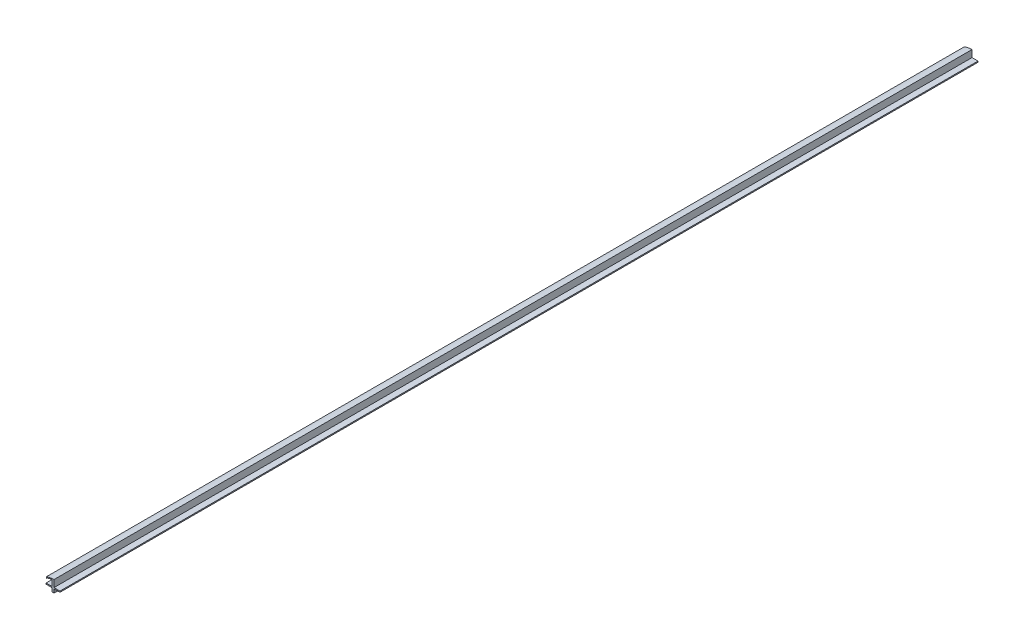
ISO-10303-21;
HEADER;
FILE_DESCRIPTION(('STEP AP214'),'2;1');
FILE_NAME('part.step','',(''),(''),'','','');
FILE_SCHEMA(('AUTOMOTIVE_DESIGN { 1 0 10303 214 1 1 1 1 }'));
ENDSEC;
DATA;
#1=APPLICATION_CONTEXT('core data for automotive mechanical design processes');
#2=APPLICATION_PROTOCOL_DEFINITION('international standard','automotive_design',2000,#1);
#3=PRODUCT_CONTEXT('',#1,'mechanical');
#4=PRODUCT('Part','Part','',(#3));
#5=PRODUCT_RELATED_PRODUCT_CATEGORY('part','',(#4));
#6=PRODUCT_DEFINITION_FORMATION('','',#4);
#7=PRODUCT_DEFINITION_CONTEXT('part definition',#1,'design');
#8=PRODUCT_DEFINITION('design','',#6,#7);
#9=PRODUCT_DEFINITION_SHAPE('','',#8);
#10=(LENGTH_UNIT() NAMED_UNIT(*) SI_UNIT(.MILLI.,.METRE.));
#11=(NAMED_UNIT(*) PLANE_ANGLE_UNIT() SI_UNIT($,.RADIAN.));
#12=(NAMED_UNIT(*) SI_UNIT($,.STERADIAN.) SOLID_ANGLE_UNIT());
#13=UNCERTAINTY_MEASURE_WITH_UNIT(LENGTH_MEASURE(1.E-05),#10,'distance_accuracy_value','');
#14=(GEOMETRIC_REPRESENTATION_CONTEXT(3) GLOBAL_UNCERTAINTY_ASSIGNED_CONTEXT((#13)) GLOBAL_UNIT_ASSIGNED_CONTEXT((#10,
#11,#12)) REPRESENTATION_CONTEXT('',''));
#15=CARTESIAN_POINT('',(0.,0.,0.));
#16=DIRECTION('',(0.,0.,1.));
#17=DIRECTION('',(1.,0.,0.));
#18=AXIS2_PLACEMENT_3D('',#15,#16,#17);
#19=CARTESIAN_POINT('',(1169.5811,22.86,533.4));
#20=DIRECTION('',(0.,1.,0.));
#21=DIRECTION('',(0.,0.,1.));
#22=AXIS2_PLACEMENT_3D('',#19,#20,#21);
#23=PLANE('',#22);
#24=DIRECTION('',(1.,0.,0.));
#25=VECTOR('',#24,1.);
#26=CARTESIAN_POINT('',(1169.5811,22.86,-533.4));
#27=LINE('',#26,#25);
#28=CARTESIAN_POINT('',(1169.5811,22.86,-533.4));
#29=VERTEX_POINT('',#28);
#30=CARTESIAN_POINT('',(1176.528,22.86,-533.4));
#31=VERTEX_POINT('',#30);
#32=EDGE_CURVE('E163',#29,#31,#27,.T.);
#33=ORIENTED_EDGE('',*,*,#32,.T.);
#34=DIRECTION('',(0.,0.,-1.));
#35=VECTOR('',#34,1.);
#36=CARTESIAN_POINT('',(1176.528,22.86,533.4));
#37=LINE('',#36,#35);
#38=CARTESIAN_POINT('',(1176.528,22.86,533.4));
#39=VERTEX_POINT('',#38);
#40=EDGE_CURVE('E11',#39,#31,#37,.T.);
#41=ORIENTED_EDGE('',*,*,#40,.F.);
#42=DIRECTION('',(1.,0.,0.));
#43=VECTOR('',#42,1.);
#44=CARTESIAN_POINT('',(1169.5811,22.86,533.4));
#45=LINE('',#44,#43);
#46=CARTESIAN_POINT('',(1169.5811,22.86,533.4));
#47=VERTEX_POINT('',#46);
#48=EDGE_CURVE('E189',#47,#39,#45,.T.);
#49=ORIENTED_EDGE('',*,*,#48,.F.);
#50=DIRECTION('',(0.,0.,-1.));
#51=VECTOR('',#50,1.);
#52=CARTESIAN_POINT('',(1169.5811,22.86,533.4));
#53=LINE('',#52,#51);
#54=EDGE_CURVE('E159',#47,#29,#53,.T.);
#55=ORIENTED_EDGE('',*,*,#54,.T.);
#56=EDGE_LOOP('',(#33,#41,#49,#55));
#57=FACE_BOUND('',#56,.T.);
#58=ADVANCED_FACE('F31',(#57),#23,.F.);
#59=CARTESIAN_POINT('',(1176.528,24.13,533.4));
#60=DIRECTION('',(-1.,0.,0.));
#61=DIRECTION('',(0.,0.,1.));
#62=AXIS2_PLACEMENT_3D('',#59,#60,#61);
#63=PLANE('',#62);
#64=DIRECTION('',(0.,1.,0.));
#65=VECTOR('',#64,1.);
#66=CARTESIAN_POINT('',(1176.528,24.13,-533.4));
#67=LINE('',#66,#65);
#68=CARTESIAN_POINT('',(1176.528,24.13,-533.4));
#69=VERTEX_POINT('',#68);
#70=EDGE_CURVE('E166',#31,#69,#67,.T.);
#71=ORIENTED_EDGE('',*,*,#70,.T.);
#72=DIRECTION('',(0.,0.,-1.));
#73=VECTOR('',#72,1.);
#74=CARTESIAN_POINT('',(1176.528,24.13,533.4));
#75=LINE('',#74,#73);
#76=CARTESIAN_POINT('',(1176.528,24.13,533.4));
#77=VERTEX_POINT('',#76);
#78=EDGE_CURVE('E39',#77,#69,#75,.T.);
#79=ORIENTED_EDGE('',*,*,#78,.F.);
#80=DIRECTION('',(0.,1.,0.));
#81=VECTOR('',#80,1.);
#82=CARTESIAN_POINT('',(1176.528,24.13,533.4));
#83=LINE('',#82,#81);
#84=EDGE_CURVE('E108',#39,#77,#83,.T.);
#85=ORIENTED_EDGE('',*,*,#84,.F.);
#86=ORIENTED_EDGE('',*,*,#40,.T.);
#87=EDGE_LOOP('',(#71,#79,#85,#86));
#88=FACE_BOUND('',#87,.T.);
#89=ADVANCED_FACE('F277',(#88),#63,.F.);
#90=CARTESIAN_POINT('',(1176.528,24.13,533.4));
#91=DIRECTION('',(0.,-1.,0.));
#92=DIRECTION('',(0.,0.,-1.));
#93=AXIS2_PLACEMENT_3D('',#90,#91,#92);
#94=PLANE('',#93);
#95=DIRECTION('',(-1.,0.,0.));
#96=VECTOR('',#95,1.);
#97=CARTESIAN_POINT('',(1176.528,24.13,-533.4));
#98=LINE('',#97,#96);
#99=CARTESIAN_POINT('',(1169.5811,24.13,-533.4));
#100=VERTEX_POINT('',#99);
#101=EDGE_CURVE('E168',#69,#100,#98,.T.);
#102=ORIENTED_EDGE('',*,*,#101,.T.);
#103=DIRECTION('',(0.,0.,-1.));
#104=VECTOR('',#103,1.);
#105=CARTESIAN_POINT('',(1169.5811,24.13,533.4));
#106=LINE('',#105,#104);
#107=CARTESIAN_POINT('',(1169.5811,24.13,533.4));
#108=VERTEX_POINT('',#107);
#109=EDGE_CURVE('E214',#108,#100,#106,.T.);
#110=ORIENTED_EDGE('',*,*,#109,.F.);
#111=DIRECTION('',(-1.,0.,0.));
#112=VECTOR('',#111,1.);
#113=CARTESIAN_POINT('',(1176.528,24.13,533.4));
#114=LINE('',#113,#112);
#115=EDGE_CURVE('E222',#77,#108,#114,.T.);
#116=ORIENTED_EDGE('',*,*,#115,.F.);
#117=ORIENTED_EDGE('',*,*,#78,.T.);
#118=EDGE_LOOP('',(#102,#110,#116,#117));
#119=FACE_BOUND('',#118,.T.);
#120=ADVANCED_FACE('F220',(#119),#94,.F.);
#121=CARTESIAN_POINT('',(1169.5811,32.258,533.4));
#122=DIRECTION('',(-1.,0.,0.));
#123=DIRECTION('',(0.,0.,1.));
#124=AXIS2_PLACEMENT_3D('',#121,#122,#123);
#125=PLANE('',#124);
#126=DIRECTION('',(0.,1.,0.));
#127=VECTOR('',#126,1.);
#128=CARTESIAN_POINT('',(1169.5811,32.258,-533.4));
#129=LINE('',#128,#127);
#130=CARTESIAN_POINT('',(1169.5811,32.258,-533.4));
#131=VERTEX_POINT('',#130);
#132=EDGE_CURVE('E170',#100,#131,#129,.T.);
#133=ORIENTED_EDGE('',*,*,#132,.T.);
#134=DIRECTION('',(0.,0.,-1.));
#135=VECTOR('',#134,1.);
#136=CARTESIAN_POINT('',(1169.5811,32.258,533.4));
#137=LINE('',#136,#135);
#138=CARTESIAN_POINT('',(1169.5811,32.258,533.4));
#139=VERTEX_POINT('',#138);
#140=EDGE_CURVE('E211',#139,#131,#137,.T.);
#141=ORIENTED_EDGE('',*,*,#140,.F.);
#142=DIRECTION('',(0.,1.,0.));
#143=VECTOR('',#142,1.);
#144=CARTESIAN_POINT('',(1169.5811,32.258,533.4));
#145=LINE('',#144,#143);
#146=EDGE_CURVE('E240',#108,#139,#145,.T.);
#147=ORIENTED_EDGE('',*,*,#146,.F.);
#148=ORIENTED_EDGE('',*,*,#109,.T.);
#149=EDGE_LOOP('',(#133,#141,#147,#148));
#150=FACE_BOUND('',#149,.T.);
#151=ADVANCED_FACE('F231',(#150),#125,.F.);
#152=CARTESIAN_POINT('',(1169.5811,9.17896278727341,533.4));
#153=DIRECTION('',(0.,0.,-1.));
#154=DIRECTION('',(-1.,0.,0.));
#155=AXIS2_PLACEMENT_3D('',#152,#153,#154);
#156=CYLINDRICAL_SURFACE('',#155,23.0790372127266);
#157=CARTESIAN_POINT('',(1169.5811,9.17896278727341,-533.4));
#158=DIRECTION('',(0.,0.,1.));
#159=DIRECTION('',(1.,0.,0.));
#160=AXIS2_PLACEMENT_3D('',#157,#158,#159);
#161=CIRCLE('',#160,23.0790372127266);
#162=CARTESIAN_POINT('',(1160.48380108106,30.3893637982359,-533.4));
#163=VERTEX_POINT('',#162);
#164=EDGE_CURVE('E172',#131,#163,#161,.T.);
#165=ORIENTED_EDGE('',*,*,#164,.T.);
#166=DIRECTION('',(0.,0.,-1.));
#167=VECTOR('',#166,1.);
#168=CARTESIAN_POINT('',(1160.48380108106,30.3893637982359,533.4));
#169=LINE('',#168,#167);
#170=CARTESIAN_POINT('',(1160.48380108106,30.3893637982359,533.4));
#171=VERTEX_POINT('',#170);
#172=EDGE_CURVE('E208',#171,#163,#169,.T.);
#173=ORIENTED_EDGE('',*,*,#172,.F.);
#174=CARTESIAN_POINT('',(1169.5811,9.17896278727341,533.4));
#175=DIRECTION('',(0.,0.,1.));
#176=DIRECTION('',(1.,0.,0.));
#177=AXIS2_PLACEMENT_3D('',#174,#175,#176);
#178=CIRCLE('',#177,23.0790372127266);
#179=EDGE_CURVE('E237',#139,#171,#178,.T.);
#180=ORIENTED_EDGE('',*,*,#179,.F.);
#181=ORIENTED_EDGE('',*,*,#140,.T.);
#182=EDGE_LOOP('',(#165,#173,#180,#181));
#183=FACE_BOUND('',#182,.T.);
#184=ADVANCED_FACE('F235',(#183),#156,.T.);
#185=CARTESIAN_POINT('',(1160.48380108106,30.3893637982359,533.4));
#186=DIRECTION('',(0.942734176006598,0.333545009540183,0.));
#187=DIRECTION('',(-0.333545009540183,0.942734176006598,0.));
#188=AXIS2_PLACEMENT_3D('',#185,#186,#187);
#189=PLANE('',#188);
#190=DIRECTION('',(0.333545009540183,-0.942734176006598,0.));
#191=VECTOR('',#190,1.);
#192=CARTESIAN_POINT('',(1160.48380108106,30.3893637982359,-533.4));
#193=LINE('',#192,#191);
#194=CARTESIAN_POINT('',(1160.90740324317,29.1920913947075,-533.4));
#195=VERTEX_POINT('',#194);
#196=EDGE_CURVE('E174',#163,#195,#193,.T.);
#197=ORIENTED_EDGE('',*,*,#196,.T.);
#198=DIRECTION('',(0.,0.,-1.));
#199=VECTOR('',#198,1.);
#200=CARTESIAN_POINT('',(1160.90740324317,29.1920913947075,533.4));
#201=LINE('',#200,#199);
#202=CARTESIAN_POINT('',(1160.90740324317,29.1920913947075,533.4));
#203=VERTEX_POINT('',#202);
#204=EDGE_CURVE('E205',#203,#195,#201,.T.);
#205=ORIENTED_EDGE('',*,*,#204,.F.);
#206=DIRECTION('',(0.333545009540183,-0.942734176006598,0.));
#207=VECTOR('',#206,1.);
#208=CARTESIAN_POINT('',(1160.48380108106,30.3893637982359,533.4));
#209=LINE('',#208,#207);
#210=EDGE_CURVE('E239',#171,#203,#209,.T.);
#211=ORIENTED_EDGE('',*,*,#210,.F.);
#212=ORIENTED_EDGE('',*,*,#172,.T.);
#213=EDGE_LOOP('',(#197,#205,#211,#212));
#214=FACE_BOUND('',#213,.T.);
#215=ADVANCED_FACE('F290',(#214),#189,.F.);
#216=CARTESIAN_POINT('',(1167.2189,18.9995616955442,533.4));
#217=DIRECTION('',(0.,0.,-1.));
#218=DIRECTION('',(-1.,0.,0.));
#219=AXIS2_PLACEMENT_3D('',#216,#217,#218);
#220=CYLINDRICAL_SURFACE('',#219,11.9884383044559);
#221=CARTESIAN_POINT('',(1167.2189,18.9995616955442,-533.4));
#222=DIRECTION('',(0.,0.,-1.));
#223=DIRECTION('',(1.,0.,0.));
#224=AXIS2_PLACEMENT_3D('',#221,#222,#223);
#225=CIRCLE('',#224,11.9884383044559);
#226=CARTESIAN_POINT('',(1167.2189,30.988,-533.4));
#227=VERTEX_POINT('',#226);
#228=EDGE_CURVE('E176',#195,#227,#225,.T.);
#229=ORIENTED_EDGE('',*,*,#228,.T.);
#230=DIRECTION('',(0.,0.,-1.));
#231=VECTOR('',#230,1.);
#232=CARTESIAN_POINT('',(1167.2189,30.988,533.4));
#233=LINE('',#232,#231);
#234=CARTESIAN_POINT('',(1167.2189,30.988,533.4));
#235=VERTEX_POINT('',#234);
#236=EDGE_CURVE('E202',#235,#227,#233,.T.);
#237=ORIENTED_EDGE('',*,*,#236,.F.);
#238=CARTESIAN_POINT('',(1167.2189,18.9995616955442,533.4));
#239=DIRECTION('',(0.,0.,-1.));
#240=DIRECTION('',(1.,0.,0.));
#241=AXIS2_PLACEMENT_3D('',#238,#239,#240);
#242=CIRCLE('',#241,11.9884383044559);
#243=EDGE_CURVE('E242',#203,#235,#242,.T.);
#244=ORIENTED_EDGE('',*,*,#243,.F.);
#245=ORIENTED_EDGE('',*,*,#204,.T.);
#246=EDGE_LOOP('',(#229,#237,#244,#245));
#247=FACE_BOUND('',#246,.T.);
#248=ADVANCED_FACE('F293',(#247),#220,.F.);
#249=CARTESIAN_POINT('',(1167.2189,30.988,533.4));
#250=DIRECTION('',(1.,0.,0.));
#251=DIRECTION('',(0.,0.,-1.));
#252=AXIS2_PLACEMENT_3D('',#249,#250,#251);
#253=PLANE('',#252);
#254=DIRECTION('',(0.,-1.,0.));
#255=VECTOR('',#254,1.);
#256=CARTESIAN_POINT('',(1167.2189,30.988,-533.4));
#257=LINE('',#256,#255);
#258=CARTESIAN_POINT('',(1167.2189,24.13,-533.4));
#259=VERTEX_POINT('',#258);
#260=EDGE_CURVE('E178',#227,#259,#257,.T.);
#261=ORIENTED_EDGE('',*,*,#260,.T.);
#262=DIRECTION('',(0.,0.,-1.));
#263=VECTOR('',#262,1.);
#264=CARTESIAN_POINT('',(1167.2189,24.13,533.4));
#265=LINE('',#264,#263);
#266=CARTESIAN_POINT('',(1167.2189,24.13,533.4));
#267=VERTEX_POINT('',#266);
#268=EDGE_CURVE('E199',#267,#259,#265,.T.);
#269=ORIENTED_EDGE('',*,*,#268,.F.);
#270=DIRECTION('',(0.,-1.,0.));
#271=VECTOR('',#270,1.);
#272=CARTESIAN_POINT('',(1167.2189,30.988,533.4));
#273=LINE('',#272,#271);
#274=EDGE_CURVE('E248',#235,#267,#273,.T.);
#275=ORIENTED_EDGE('',*,*,#274,.F.);
#276=ORIENTED_EDGE('',*,*,#236,.T.);
#277=EDGE_LOOP('',(#261,#269,#275,#276));
#278=FACE_BOUND('',#277,.T.);
#279=ADVANCED_FACE('F297',(#278),#253,.F.);
#280=CARTESIAN_POINT('',(1160.272,24.13,533.4));
#281=DIRECTION('',(0.,-1.,0.));
#282=DIRECTION('',(0.,0.,-1.));
#283=AXIS2_PLACEMENT_3D('',#280,#281,#282);
#284=PLANE('',#283);
#285=DIRECTION('',(-1.,0.,0.));
#286=VECTOR('',#285,1.);
#287=CARTESIAN_POINT('',(1160.272,24.13,-533.4));
#288=LINE('',#287,#286);
#289=CARTESIAN_POINT('',(1160.272,24.13,-533.4));
#290=VERTEX_POINT('',#289);
#291=EDGE_CURVE('E180',#259,#290,#288,.T.);
#292=ORIENTED_EDGE('',*,*,#291,.T.);
#293=DIRECTION('',(0.,0.,-1.));
#294=VECTOR('',#293,1.);
#295=CARTESIAN_POINT('',(1160.272,24.13,533.4));
#296=LINE('',#295,#294);
#297=CARTESIAN_POINT('',(1160.272,24.13,533.4));
#298=VERTEX_POINT('',#297);
#299=EDGE_CURVE('E196',#298,#290,#296,.T.);
#300=ORIENTED_EDGE('',*,*,#299,.F.);
#301=DIRECTION('',(-1.,0.,0.));
#302=VECTOR('',#301,1.);
#303=CARTESIAN_POINT('',(1160.272,24.13,533.4));
#304=LINE('',#303,#302);
#305=EDGE_CURVE('E250',#267,#298,#304,.T.);
#306=ORIENTED_EDGE('',*,*,#305,.F.);
#307=ORIENTED_EDGE('',*,*,#268,.T.);
#308=EDGE_LOOP('',(#292,#300,#306,#307));
#309=FACE_BOUND('',#308,.T.);
#310=ADVANCED_FACE('F301',(#309),#284,.F.);
#311=CARTESIAN_POINT('',(1160.272,24.13,533.4));
#312=DIRECTION('',(1.,0.,0.));
#313=DIRECTION('',(0.,0.,-1.));
#314=AXIS2_PLACEMENT_3D('',#311,#312,#313);
#315=PLANE('',#314);
#316=DIRECTION('',(0.,-1.,0.));
#317=VECTOR('',#316,1.);
#318=CARTESIAN_POINT('',(1160.272,24.13,-533.4));
#319=LINE('',#318,#317);
#320=CARTESIAN_POINT('',(1160.272,22.86,-533.4));
#321=VERTEX_POINT('',#320);
#322=EDGE_CURVE('E182',#290,#321,#319,.T.);
#323=ORIENTED_EDGE('',*,*,#322,.T.);
#324=DIRECTION('',(0.,0.,-1.));
#325=VECTOR('',#324,1.);
#326=CARTESIAN_POINT('',(1160.272,22.86,533.4));
#327=LINE('',#326,#325);
#328=CARTESIAN_POINT('',(1160.272,22.86,533.4));
#329=VERTEX_POINT('',#328);
#330=EDGE_CURVE('E193',#329,#321,#327,.T.);
#331=ORIENTED_EDGE('',*,*,#330,.F.);
#332=DIRECTION('',(0.,-1.,0.));
#333=VECTOR('',#332,1.);
#334=CARTESIAN_POINT('',(1160.272,24.13,533.4));
#335=LINE('',#334,#333);
#336=EDGE_CURVE('E252',#298,#329,#335,.T.);
#337=ORIENTED_EDGE('',*,*,#336,.F.);
#338=ORIENTED_EDGE('',*,*,#299,.T.);
#339=EDGE_LOOP('',(#323,#331,#337,#338));
#340=FACE_BOUND('',#339,.T.);
#341=ADVANCED_FACE('F258',(#340),#315,.F.);
#342=CARTESIAN_POINT('',(1160.272,22.86,533.4));
#343=DIRECTION('',(0.,1.,0.));
#344=DIRECTION('',(0.,0.,1.));
#345=AXIS2_PLACEMENT_3D('',#342,#343,#344);
#346=PLANE('',#345);
#347=DIRECTION('',(1.,0.,0.));
#348=VECTOR('',#347,1.);
#349=CARTESIAN_POINT('',(1160.272,22.86,-533.4));
#350=LINE('',#349,#348);
#351=CARTESIAN_POINT('',(1167.2189,22.86,-533.4));
#352=VERTEX_POINT('',#351);
#353=EDGE_CURVE('E184',#321,#352,#350,.T.);
#354=ORIENTED_EDGE('',*,*,#353,.T.);
#355=DIRECTION('',(0.,0.,-1.));
#356=VECTOR('',#355,1.);
#357=CARTESIAN_POINT('',(1167.2189,22.86,533.4));
#358=LINE('',#357,#356);
#359=CARTESIAN_POINT('',(1167.2189,22.86,533.4));
#360=VERTEX_POINT('',#359);
#361=EDGE_CURVE('E154',#360,#352,#358,.T.);
#362=ORIENTED_EDGE('',*,*,#361,.F.);
#363=DIRECTION('',(1.,0.,0.));
#364=VECTOR('',#363,1.);
#365=CARTESIAN_POINT('',(1160.272,22.86,533.4));
#366=LINE('',#365,#364);
#367=EDGE_CURVE('E145',#329,#360,#366,.T.);
#368=ORIENTED_EDGE('',*,*,#367,.F.);
#369=ORIENTED_EDGE('',*,*,#330,.T.);
#370=EDGE_LOOP('',(#354,#362,#368,#369));
#371=FACE_BOUND('',#370,.T.);
#372=ADVANCED_FACE('F262',(#371),#346,.F.);
#373=CARTESIAN_POINT('',(1167.2189,22.86,533.4));
#374=DIRECTION('',(1.,0.,0.));
#375=DIRECTION('',(0.,0.,-1.));
#376=AXIS2_PLACEMENT_3D('',#373,#374,#375);
#377=PLANE('',#376);
#378=DIRECTION('',(0.,-1.,0.));
#379=VECTOR('',#378,1.);
#380=CARTESIAN_POINT('',(1167.2189,22.86,-533.4));
#381=LINE('',#380,#379);
#382=CARTESIAN_POINT('',(1167.2189,18.542,-533.4));
#383=VERTEX_POINT('',#382);
#384=EDGE_CURVE('E153',#352,#383,#381,.T.);
#385=ORIENTED_EDGE('',*,*,#384,.T.);
#386=DIRECTION('',(0.,0.,-1.));
#387=VECTOR('',#386,1.);
#388=CARTESIAN_POINT('',(1167.2189,18.542,533.4));
#389=LINE('',#388,#387);
#390=CARTESIAN_POINT('',(1167.2189,18.542,533.4));
#391=VERTEX_POINT('',#390);
#392=EDGE_CURVE('E150',#391,#383,#389,.T.);
#393=ORIENTED_EDGE('',*,*,#392,.F.);
#394=DIRECTION('',(0.,-1.,0.));
#395=VECTOR('',#394,1.);
#396=CARTESIAN_POINT('',(1167.2189,22.86,533.4));
#397=LINE('',#396,#395);
#398=EDGE_CURVE('E139',#360,#391,#397,.T.);
#399=ORIENTED_EDGE('',*,*,#398,.F.);
#400=ORIENTED_EDGE('',*,*,#361,.T.);
#401=EDGE_LOOP('',(#385,#393,#399,#400));
#402=FACE_BOUND('',#401,.T.);
#403=ADVANCED_FACE('F151',(#402),#377,.F.);
#404=CARTESIAN_POINT('',(1169.5811,18.542,533.4));
#405=DIRECTION('',(0.,1.,0.));
#406=DIRECTION('',(0.,0.,1.));
#407=AXIS2_PLACEMENT_3D('',#404,#405,#406);
#408=PLANE('',#407);
#409=DIRECTION('',(1.,0.,0.));
#410=VECTOR('',#409,1.);
#411=CARTESIAN_POINT('',(1169.5811,18.542,-533.4));
#412=LINE('',#411,#410);
#413=CARTESIAN_POINT('',(1169.5811,18.542,-533.4));
#414=VERTEX_POINT('',#413);
#415=EDGE_CURVE('E94',#383,#414,#412,.T.);
#416=ORIENTED_EDGE('',*,*,#415,.T.);
#417=DIRECTION('',(0.,0.,-1.));
#418=VECTOR('',#417,1.);
#419=CARTESIAN_POINT('',(1169.5811,18.542,533.4));
#420=LINE('',#419,#418);
#421=CARTESIAN_POINT('',(1169.5811,18.542,533.4));
#422=VERTEX_POINT('',#421);
#423=EDGE_CURVE('E155',#422,#414,#420,.T.);
#424=ORIENTED_EDGE('',*,*,#423,.F.);
#425=DIRECTION('',(1.,0.,0.));
#426=VECTOR('',#425,1.);
#427=CARTESIAN_POINT('',(1169.5811,18.542,533.4));
#428=LINE('',#427,#426);
#429=EDGE_CURVE('E143',#391,#422,#428,.T.);
#430=ORIENTED_EDGE('',*,*,#429,.F.);
#431=ORIENTED_EDGE('',*,*,#392,.T.);
#432=EDGE_LOOP('',(#416,#424,#430,#431));
#433=FACE_BOUND('',#432,.T.);
#434=ADVANCED_FACE('F157',(#433),#408,.F.);
#435=CARTESIAN_POINT('',(1169.5811,22.86,533.4));
#436=DIRECTION('',(-1.,0.,0.));
#437=DIRECTION('',(0.,0.,1.));
#438=AXIS2_PLACEMENT_3D('',#435,#436,#437);
#439=PLANE('',#438);
#440=DIRECTION('',(0.,1.,0.));
#441=VECTOR('',#440,1.);
#442=CARTESIAN_POINT('',(1169.5811,22.86,-533.4));
#443=LINE('',#442,#441);
#444=EDGE_CURVE('E100',#414,#29,#443,.T.);
#445=ORIENTED_EDGE('',*,*,#444,.T.);
#446=ORIENTED_EDGE('',*,*,#54,.F.);
#447=DIRECTION('',(0.,1.,0.));
#448=VECTOR('',#447,1.);
#449=CARTESIAN_POINT('',(1169.5811,22.86,533.4));
#450=LINE('',#449,#448);
#451=EDGE_CURVE('E47',#422,#47,#450,.T.);
#452=ORIENTED_EDGE('',*,*,#451,.F.);
#453=ORIENTED_EDGE('',*,*,#423,.T.);
#454=EDGE_LOOP('',(#445,#446,#452,#453));
#455=FACE_BOUND('',#454,.T.);
#456=ADVANCED_FACE('F266',(#455),#439,.F.);
#457=CARTESIAN_POINT('',(1169.5811,9.17896278727341,533.4));
#458=DIRECTION('',(0.,0.,1.));
#459=DIRECTION('',(1.,0.,0.));
#460=AXIS2_PLACEMENT_3D('',#457,#458,#459);
#461=PLANE('',#460);
#462=ORIENTED_EDGE('',*,*,#48,.T.);
#463=ORIENTED_EDGE('',*,*,#84,.T.);
#464=ORIENTED_EDGE('',*,*,#115,.T.);
#465=ORIENTED_EDGE('',*,*,#146,.T.);
#466=ORIENTED_EDGE('',*,*,#179,.T.);
#467=ORIENTED_EDGE('',*,*,#210,.T.);
#468=ORIENTED_EDGE('',*,*,#243,.T.);
#469=ORIENTED_EDGE('',*,*,#274,.T.);
#470=ORIENTED_EDGE('',*,*,#305,.T.);
#471=ORIENTED_EDGE('',*,*,#336,.T.);
#472=ORIENTED_EDGE('',*,*,#367,.T.);
#473=ORIENTED_EDGE('',*,*,#398,.T.);
#474=ORIENTED_EDGE('',*,*,#429,.T.);
#475=ORIENTED_EDGE('',*,*,#451,.T.);
#476=EDGE_LOOP('',(#462,#463,#464,#465,#466,#467,#468,#469,#470,#471,#472,#473,#474,#475));
#477=FACE_BOUND('',#476,.T.);
#478=ADVANCED_FACE('F141',(#477),#461,.T.);
#479=CARTESIAN_POINT('',(1169.5811,9.17896278727341,-533.4));
#480=DIRECTION('',(0.,0.,1.));
#481=DIRECTION('',(1.,0.,0.));
#482=AXIS2_PLACEMENT_3D('',#479,#480,#481);
#483=PLANE('',#482);
#484=ORIENTED_EDGE('',*,*,#32,.F.);
#485=ORIENTED_EDGE('',*,*,#444,.F.);
#486=ORIENTED_EDGE('',*,*,#415,.F.);
#487=ORIENTED_EDGE('',*,*,#384,.F.);
#488=ORIENTED_EDGE('',*,*,#353,.F.);
#489=ORIENTED_EDGE('',*,*,#322,.F.);
#490=ORIENTED_EDGE('',*,*,#291,.F.);
#491=ORIENTED_EDGE('',*,*,#260,.F.);
#492=ORIENTED_EDGE('',*,*,#228,.F.);
#493=ORIENTED_EDGE('',*,*,#196,.F.);
#494=ORIENTED_EDGE('',*,*,#164,.F.);
#495=ORIENTED_EDGE('',*,*,#132,.F.);
#496=ORIENTED_EDGE('',*,*,#101,.F.);
#497=ORIENTED_EDGE('',*,*,#70,.F.);
#498=EDGE_LOOP('',(#484,#485,#486,#487,#488,#489,#490,#491,#492,#493,#494,#495,#496,#497));
#499=FACE_BOUND('',#498,.T.);
#500=ADVANCED_FACE('F226',(#499),#483,.F.);
#501=CLOSED_SHELL('',(#58,#89,#120,#151,#184,#215,#248,#279,#310,#341,#372,#403,#434,#456,#478,#500));
#502=MANIFOLD_SOLID_BREP('B2',#501);
#503=ADVANCED_BREP_SHAPE_REPRESENTATION('',(#18,#502),#14);
#504=SHAPE_DEFINITION_REPRESENTATION(#9,#503);
ENDSEC;
END-ISO-10303-21;
